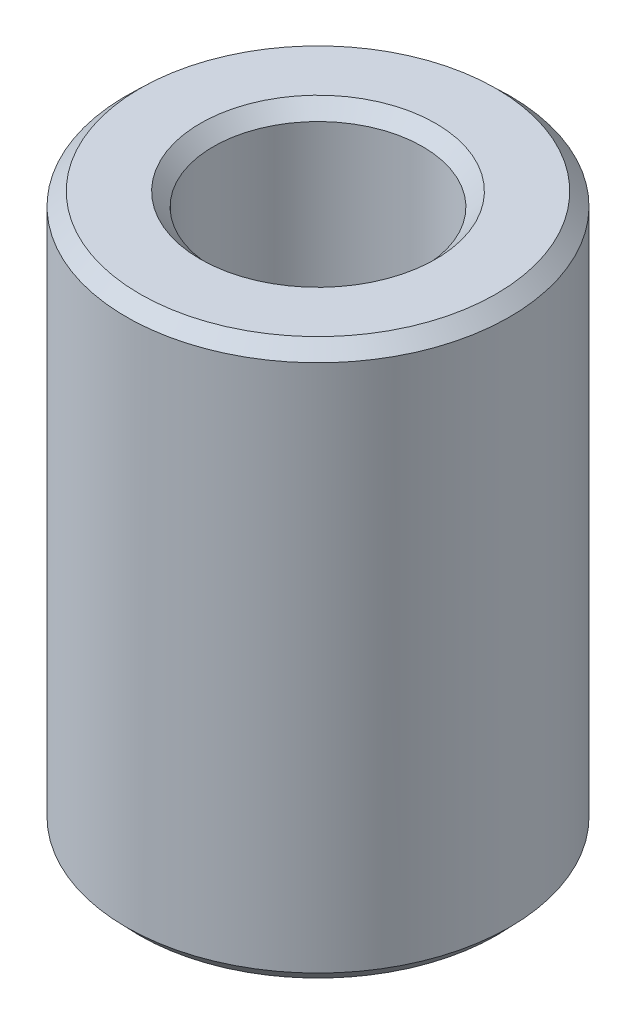
ISO-10303-21;
HEADER;
FILE_DESCRIPTION(('STEP AP214'),'2;1');
FILE_NAME('part.step','',(''),(''),'','','');
FILE_SCHEMA(('AUTOMOTIVE_DESIGN { 1 0 10303 214 1 1 1 1 }'));
ENDSEC;
DATA;
#1=APPLICATION_CONTEXT('core data for automotive mechanical design processes');
#2=APPLICATION_PROTOCOL_DEFINITION('international standard','automotive_design',2000,#1);
#3=PRODUCT_CONTEXT('',#1,'mechanical');
#4=PRODUCT('Part','Part','',(#3));
#5=PRODUCT_RELATED_PRODUCT_CATEGORY('part','',(#4));
#6=PRODUCT_DEFINITION_FORMATION('','',#4);
#7=PRODUCT_DEFINITION_CONTEXT('part definition',#1,'design');
#8=PRODUCT_DEFINITION('design','',#6,#7);
#9=PRODUCT_DEFINITION_SHAPE('','',#8);
#10=(LENGTH_UNIT() NAMED_UNIT(*) SI_UNIT(.MILLI.,.METRE.));
#11=(NAMED_UNIT(*) PLANE_ANGLE_UNIT() SI_UNIT($,.RADIAN.));
#12=(NAMED_UNIT(*) SI_UNIT($,.STERADIAN.) SOLID_ANGLE_UNIT());
#13=UNCERTAINTY_MEASURE_WITH_UNIT(LENGTH_MEASURE(1.E-05),#10,'distance_accuracy_value','');
#14=(GEOMETRIC_REPRESENTATION_CONTEXT(3) GLOBAL_UNCERTAINTY_ASSIGNED_CONTEXT((#13)) GLOBAL_UNIT_ASSIGNED_CONTEXT((#10,
#11,#12)) REPRESENTATION_CONTEXT('',''));
#15=CARTESIAN_POINT('',(0.,0.,0.));
#16=DIRECTION('',(0.,0.,1.));
#17=DIRECTION('',(1.,0.,0.));
#18=AXIS2_PLACEMENT_3D('',#15,#16,#17);
#19=CARTESIAN_POINT('',(0.,28.9694790083316,0.));
#20=DIRECTION('',(0.,-1.,0.));
#21=DIRECTION('',(0.,0.,-1.));
#22=AXIS2_PLACEMENT_3D('',#19,#20,#21);
#23=CYLINDRICAL_SURFACE('',#22,10.);
#24=CARTESIAN_POINT('',(0.,0.708660389524194,0.));
#25=DIRECTION('',(0.,1.,0.));
#26=DIRECTION('',(0.,0.,1.));
#27=AXIS2_PLACEMENT_3D('',#24,#25,#26);
#28=CIRCLE('',#27,10.);
#29=CARTESIAN_POINT('',(0.,0.708660389524191,-10.));
#30=VERTEX_POINT('',#29);
#31=EDGE_CURVE('E10',#30,#30,#28,.T.);
#32=CARTESIAN_POINT('',(0.,28.2883303676083,0.));
#33=DIRECTION('',(0.,1.,0.));
#34=DIRECTION('',(0.,0.,1.));
#35=AXIS2_PLACEMENT_3D('',#32,#33,#34);
#36=CIRCLE('',#35,10.);
#37=CARTESIAN_POINT('',(0.,28.2883303676083,-10.));
#38=VERTEX_POINT('',#37);
#39=EDGE_CURVE('E50',#38,#38,#36,.F.);
#40=CARTESIAN_POINT('',(0.,0.708660389524191,-10.));
#41=CARTESIAN_POINT('',(0.,0.995948618462567,-10.));
#42=CARTESIAN_POINT('',(0.,1.28323684740094,-10.));
#43=CARTESIAN_POINT('',(0.,1.8578133052777,-10.));
#44=CARTESIAN_POINT('',(0.,2.14510153421607,-10.));
#45=CARTESIAN_POINT('',(0.,2.71967799209282,-10.));
#46=CARTESIAN_POINT('',(0.,3.0069662210312,-10.));
#47=CARTESIAN_POINT('',(0.,3.58154267890795,-10.));
#48=CARTESIAN_POINT('',(0.,3.86883090784633,-10.));
#49=CARTESIAN_POINT('',(0.,4.44340736572308,-10.));
#50=CARTESIAN_POINT('',(0.,4.73069559466146,-10.));
#51=CARTESIAN_POINT('',(0.,5.30527205253821,-10.));
#52=CARTESIAN_POINT('',(0.,5.59256028147658,-10.));
#53=CARTESIAN_POINT('',(0.,6.16713673935334,-10.));
#54=CARTESIAN_POINT('',(0.,6.45442496829171,-10.));
#55=CARTESIAN_POINT('',(0.,7.02900142616846,-10.));
#56=CARTESIAN_POINT('',(0.,7.31628965510684,-10.));
#57=CARTESIAN_POINT('',(0.,7.89086611298359,-10.));
#58=CARTESIAN_POINT('',(0.,8.17815434192197,-10.));
#59=CARTESIAN_POINT('',(0.,8.75273079979872,-10.));
#60=CARTESIAN_POINT('',(0.,9.04001902873709,-10.));
#61=CARTESIAN_POINT('',(0.,9.61459548661385,-10.));
#62=CARTESIAN_POINT('',(0.,9.90188371555222,-10.));
#63=CARTESIAN_POINT('',(0.,10.476460173429,-10.));
#64=CARTESIAN_POINT('',(0.,10.7637484023673,-10.));
#65=CARTESIAN_POINT('',(0.,11.3383248602441,-10.));
#66=CARTESIAN_POINT('',(0.,11.6256130891825,-10.));
#67=CARTESIAN_POINT('',(0.,12.2001895470592,-10.));
#68=CARTESIAN_POINT('',(0.,12.4874777759976,-10.));
#69=CARTESIAN_POINT('',(0.,13.0620542338744,-10.));
#70=CARTESIAN_POINT('',(0.,13.3493424628127,-10.));
#71=CARTESIAN_POINT('',(0.,13.9239189206895,-10.));
#72=CARTESIAN_POINT('',(0.,14.2112071496279,-10.));
#73=CARTESIAN_POINT('',(0.,14.7857836075046,-10.));
#74=CARTESIAN_POINT('',(0.,15.073071836443,-10.));
#75=CARTESIAN_POINT('',(0.,15.6476482943197,-10.));
#76=CARTESIAN_POINT('',(0.,15.9349365232581,-10.));
#77=CARTESIAN_POINT('',(0.,16.5095129811349,-10.));
#78=CARTESIAN_POINT('',(0.,16.7968012100732,-10.));
#79=CARTESIAN_POINT('',(0.,17.37137766795,-10.));
#80=CARTESIAN_POINT('',(0.,17.6586658968884,-10.));
#81=CARTESIAN_POINT('',(0.,18.2332423547651,-10.));
#82=CARTESIAN_POINT('',(0.,18.5205305837035,-10.));
#83=CARTESIAN_POINT('',(0.,19.0951070415802,-10.));
#84=CARTESIAN_POINT('',(0.,19.3823952705186,-10.));
#85=CARTESIAN_POINT('',(0.,19.9569717283954,-10.));
#86=CARTESIAN_POINT('',(0.,20.2442599573338,-10.));
#87=CARTESIAN_POINT('',(0.,20.8188364152105,-10.));
#88=CARTESIAN_POINT('',(0.,21.1061246441489,-10.));
#89=CARTESIAN_POINT('',(0.,21.6807011020256,-10.));
#90=CARTESIAN_POINT('',(0.,21.967989330964,-10.));
#91=CARTESIAN_POINT('',(0.,22.5425657888408,-10.));
#92=CARTESIAN_POINT('',(0.,22.8298540177791,-10.));
#93=CARTESIAN_POINT('',(0.,23.4044304756559,-10.));
#94=CARTESIAN_POINT('',(0.,23.6917187045943,-10.));
#95=CARTESIAN_POINT('',(0.,24.266295162471,-10.));
#96=CARTESIAN_POINT('',(0.,24.5535833914094,-10.));
#97=CARTESIAN_POINT('',(0.,25.1281598492861,-10.));
#98=CARTESIAN_POINT('',(0.,25.4154480782245,-10.));
#99=CARTESIAN_POINT('',(0.,25.9900245361013,-10.));
#100=CARTESIAN_POINT('',(0.,26.2773127650396,-10.));
#101=CARTESIAN_POINT('',(0.,26.8518892229164,-10.));
#102=CARTESIAN_POINT('',(0.,27.1391774518548,-10.));
#103=CARTESIAN_POINT('',(0.,27.7137539097315,-10.));
#104=CARTESIAN_POINT('',(0.,28.0010421386699,-10.));
#105=CARTESIAN_POINT('',(0.,28.2883303676083,-10.));
#106=B_SPLINE_CURVE_WITH_KNOTS('',3,(#40,#41,#42,#43,#44,#45,#46,#47,#48,#49,#50,#51,#52,#53,
#54,#55,#56,#57,#58,#59,#60,#61,#62,#63,#64,#65,#66,#67,#68,#69,#70,#71,#72,#73,#74,#75,#76,#77,
#78,#79,#80,#81,#82,#83,#84,#85,#86,#87,#88,#89,#90,#91,#92,#93,#94,#95,#96,#97,#98,#99,#100,
#101,#102,#103,#104,#105),.UNSPECIFIED.,.F.,.F.,(4,2,2,2,2,2,2,2,2,2,2,2,2,2,2,2,2,2,2,2,2,2,2,
2,2,2,2,2,2,2,2,2,4),(0.,0.861864686815129,1.72372937363026,2.58559406044539,3.44745874726051,
4.30932343407564,5.17118812089077,6.0330528077059,6.89491749452102,7.75678218133615,
8.61864686815128,9.48051155496641,10.3423762417815,11.2042409285967,12.0661056154118,
12.9279703022269,13.789834989042,14.6516996758572,15.5135643626723,16.3754290494874,
17.2372937363026,18.0991584231177,18.9610231099328,19.8228877967479,20.6847524835631,
21.5466171703782,22.4084818571933,23.2703465440085,24.1322112308236,24.9940759176387,
25.8559406044538,26.717805291269,27.5796699780841),.UNSPECIFIED.);
#107=EDGE_CURVE('BSEAM39',#30,#38,#106,.T.);
#108=ORIENTED_EDGE('',*,*,#31,.T.);
#109=ORIENTED_EDGE('',*,*,#39,.T.);
#110=ORIENTED_EDGE('',*,*,#107,.T.);
#111=ORIENTED_EDGE('',*,*,#107,.F.);
#112=EDGE_LOOP('',(#108,#110,#109,#111));
#113=FACE_BOUND('',#112,.T.);
#114=ADVANCED_FACE('F39',(#113),#23,.T.);
#115=CARTESIAN_POINT('',(0.,28.9694790083316,0.));
#116=DIRECTION('',(0.,1.,0.));
#117=DIRECTION('',(0.,0.,1.));
#118=AXIS2_PLACEMENT_3D('',#115,#116,#117);
#119=PLANE('',#118);
#120=CARTESIAN_POINT('',(0.,28.9694790083316,0.));
#121=DIRECTION('',(0.,1.,0.));
#122=DIRECTION('',(0.,0.,1.));
#123=AXIS2_PLACEMENT_3D('',#120,#121,#122);
#124=CIRCLE('',#123,6.14048397947353);
#125=CARTESIAN_POINT('',(0.,28.9694790083316,6.14048397947353));
#126=VERTEX_POINT('',#125);
#127=EDGE_CURVE('E58',#126,#126,#124,.F.);
#128=ORIENTED_EDGE('',*,*,#127,.T.);
#129=EDGE_LOOP('',(#128));
#130=FACE_BOUND('',#129,.T.);
#131=CARTESIAN_POINT('',(0.,28.9694790083316,0.));
#132=DIRECTION('',(0.,1.,0.));
#133=DIRECTION('',(0.,0.,1.));
#134=AXIS2_PLACEMENT_3D('',#131,#132,#133);
#135=CIRCLE('',#134,9.29133961047585);
#136=CARTESIAN_POINT('',(0.,28.9694790083316,9.29133961047585));
#137=VERTEX_POINT('',#136);
#138=EDGE_CURVE('E61',#137,#137,#135,.T.);
#139=ORIENTED_EDGE('',*,*,#138,.T.);
#140=EDGE_LOOP('',(#139));
#141=FACE_BOUND('',#140,.T.);
#142=ADVANCED_FACE('F88',(#130,#141),#119,.T.);
#143=CARTESIAN_POINT('',(0.,0.,0.));
#144=DIRECTION('',(0.,1.,0.));
#145=DIRECTION('',(0.,0.,1.));
#146=AXIS2_PLACEMENT_3D('',#143,#144,#145);
#147=PLANE('',#146);
#148=CARTESIAN_POINT('',(0.,0.,0.));
#149=DIRECTION('',(0.,1.,0.));
#150=DIRECTION('',(0.,0.,1.));
#151=AXIS2_PLACEMENT_3D('',#148,#149,#150);
#152=CIRCLE('',#151,6.16799572827433);
#153=CARTESIAN_POINT('',(0.,0.,6.16799572827433));
#154=VERTEX_POINT('',#153);
#155=EDGE_CURVE('E51',#154,#154,#152,.T.);
#156=ORIENTED_EDGE('',*,*,#155,.T.);
#157=EDGE_LOOP('',(#156));
#158=FACE_BOUND('',#157,.T.);
#159=CARTESIAN_POINT('',(0.,0.,0.));
#160=DIRECTION('',(0.,1.,0.));
#161=DIRECTION('',(0.,0.,1.));
#162=AXIS2_PLACEMENT_3D('',#159,#160,#161);
#163=CIRCLE('',#162,9.31885135927664);
#164=CARTESIAN_POINT('',(0.,0.,9.31885135927664));
#165=VERTEX_POINT('',#164);
#166=EDGE_CURVE('E54',#165,#165,#163,.F.);
#167=ORIENTED_EDGE('',*,*,#166,.T.);
#168=EDGE_LOOP('',(#167));
#169=FACE_BOUND('',#168,.T.);
#170=ADVANCED_FACE('F83',(#158,#169),#147,.F.);
#171=CARTESIAN_POINT('',(0.,28.9694790083316,0.));
#172=DIRECTION('',(0.,-1.,0.));
#173=DIRECTION('',(0.,0.,-1.));
#174=AXIS2_PLACEMENT_3D('',#171,#172,#173);
#175=CYLINDRICAL_SURFACE('',#174,5.45933533875017);
#176=CARTESIAN_POINT('',(0.,28.2608186188074,0.));
#177=DIRECTION('',(0.,1.,0.));
#178=DIRECTION('',(0.,0.,1.));
#179=AXIS2_PLACEMENT_3D('',#176,#177,#178);
#180=CIRCLE('',#179,5.45933533875017);
#181=CARTESIAN_POINT('',(0.,28.2608186188074,-5.45933533875017));
#182=VERTEX_POINT('',#181);
#183=EDGE_CURVE('E67',#182,#182,#180,.T.);
#184=CARTESIAN_POINT('',(0.,0.681148640723325,0.));
#185=DIRECTION('',(0.,1.,0.));
#186=DIRECTION('',(0.,0.,1.));
#187=AXIS2_PLACEMENT_3D('',#184,#185,#186);
#188=CIRCLE('',#187,5.45933533875017);
#189=CARTESIAN_POINT('',(0.,0.681148640723321,-5.45933533875017));
#190=VERTEX_POINT('',#189);
#191=EDGE_CURVE('E69',#190,#190,#188,.F.);
#192=CARTESIAN_POINT('',(0.,28.2608186188074,-5.45933533875017));
#193=CARTESIAN_POINT('',(0.,27.973530389869,-5.45933533875017));
#194=CARTESIAN_POINT('',(0.,27.6862421609306,-5.45933533875017));
#195=CARTESIAN_POINT('',(0.,27.1116657030539,-5.45933533875017));
#196=CARTESIAN_POINT('',(0.,26.8243774741155,-5.45933533875017));
#197=CARTESIAN_POINT('',(0.,26.2498010162388,-5.45933533875017));
#198=CARTESIAN_POINT('',(0.,25.9625127873004,-5.45933533875017));
#199=CARTESIAN_POINT('',(0.,25.3879363294236,-5.45933533875017));
#200=CARTESIAN_POINT('',(0.,25.1006481004853,-5.45933533875017));
#201=CARTESIAN_POINT('',(0.,24.5260716426085,-5.45933533875017));
#202=CARTESIAN_POINT('',(0.,24.2387834136701,-5.45933533875017));
#203=CARTESIAN_POINT('',(0.,23.6642069557934,-5.45933533875017));
#204=CARTESIAN_POINT('',(0.,23.376918726855,-5.45933533875017));
#205=CARTESIAN_POINT('',(0.,22.8023422689783,-5.45933533875017));
#206=CARTESIAN_POINT('',(0.,22.5150540400399,-5.45933533875017));
#207=CARTESIAN_POINT('',(0.,21.9404775821631,-5.45933533875017));
#208=CARTESIAN_POINT('',(0.,21.6531893532248,-5.45933533875017));
#209=CARTESIAN_POINT('',(0.,21.078612895348,-5.45933533875017));
#210=CARTESIAN_POINT('',(0.,20.7913246664096,-5.45933533875017));
#211=CARTESIAN_POINT('',(0.,20.2167482085329,-5.45933533875017));
#212=CARTESIAN_POINT('',(0.,19.9294599795945,-5.45933533875017));
#213=CARTESIAN_POINT('',(0.,19.3548835217178,-5.45933533875017));
#214=CARTESIAN_POINT('',(0.,19.0675952927794,-5.45933533875017));
#215=CARTESIAN_POINT('',(0.,18.4930188349026,-5.45933533875017));
#216=CARTESIAN_POINT('',(0.,18.2057306059642,-5.45933533875017));
#217=CARTESIAN_POINT('',(0.,17.6311541480875,-5.45933533875017));
#218=CARTESIAN_POINT('',(0.,17.3438659191491,-5.45933533875017));
#219=CARTESIAN_POINT('',(0.,16.7692894612724,-5.45933533875017));
#220=CARTESIAN_POINT('',(0.,16.482001232334,-5.45933533875017));
#221=CARTESIAN_POINT('',(0.,15.9074247744572,-5.45933533875017));
#222=CARTESIAN_POINT('',(0.,15.6201365455189,-5.45933533875017));
#223=CARTESIAN_POINT('',(0.,15.0455600876421,-5.45933533875017));
#224=CARTESIAN_POINT('',(0.,14.7582718587037,-5.45933533875017));
#225=CARTESIAN_POINT('',(0.,14.183695400827,-5.45933533875017));
#226=CARTESIAN_POINT('',(0.,13.8964071718886,-5.45933533875017));
#227=CARTESIAN_POINT('',(0.,13.3218307140119,-5.45933533875017));
#228=CARTESIAN_POINT('',(0.,13.0345424850735,-5.45933533875017));
#229=CARTESIAN_POINT('',(0.,12.4599660271967,-5.45933533875017));
#230=CARTESIAN_POINT('',(0.,12.1726777982584,-5.45933533875017));
#231=CARTESIAN_POINT('',(0.,11.5981013403816,-5.45933533875017));
#232=CARTESIAN_POINT('',(0.,11.3108131114432,-5.45933533875017));
#233=CARTESIAN_POINT('',(0.,10.7362366535665,-5.45933533875017));
#234=CARTESIAN_POINT('',(0.,10.4489484246281,-5.45933533875017));
#235=CARTESIAN_POINT('',(0.,9.87437196675135,-5.45933533875017));
#236=CARTESIAN_POINT('',(0.,9.58708373781297,-5.45933533875017));
#237=CARTESIAN_POINT('',(0.,9.01250727993622,-5.45933533875017));
#238=CARTESIAN_POINT('',(0.,8.72521905099784,-5.45933533875017));
#239=CARTESIAN_POINT('',(0.,8.15064259312109,-5.45933533875017));
#240=CARTESIAN_POINT('',(0.,7.86335436418272,-5.45933533875017));
#241=CARTESIAN_POINT('',(0.,7.28877790630597,-5.45933533875017));
#242=CARTESIAN_POINT('',(0.,7.00148967736759,-5.45933533875017));
#243=CARTESIAN_POINT('',(0.,6.42691321949084,-5.45933533875017));
#244=CARTESIAN_POINT('',(0.,6.13962499055246,-5.45933533875017));
#245=CARTESIAN_POINT('',(0.,5.56504853267571,-5.45933533875017));
#246=CARTESIAN_POINT('',(0.,5.27776030373733,-5.45933533875017));
#247=CARTESIAN_POINT('',(0.,4.70318384586058,-5.45933533875017));
#248=CARTESIAN_POINT('',(0.,4.41589561692221,-5.45933533875017));
#249=CARTESIAN_POINT('',(0.,3.84131915904546,-5.45933533875017));
#250=CARTESIAN_POINT('',(0.,3.55403093010708,-5.45933533875017));
#251=CARTESIAN_POINT('',(0.,2.97945447223033,-5.45933533875017));
#252=CARTESIAN_POINT('',(0.,2.69216624329195,-5.45933533875017));
#253=CARTESIAN_POINT('',(0.,2.1175897854152,-5.45933533875017));
#254=CARTESIAN_POINT('',(0.,1.83030155647682,-5.45933533875017));
#255=CARTESIAN_POINT('',(0.,1.25572509860007,-5.45933533875017));
#256=CARTESIAN_POINT('',(0.,0.968436869661696,-5.45933533875017));
#257=CARTESIAN_POINT('',(0.,0.681148640723321,-5.45933533875017));
#258=B_SPLINE_CURVE_WITH_KNOTS('',3,(#192,#193,#194,#195,#196,#197,#198,#199,#200,#201,#202,
#203,#204,#205,#206,#207,#208,#209,#210,#211,#212,#213,#214,#215,#216,#217,#218,#219,#220,#221,
#222,#223,#224,#225,#226,#227,#228,#229,#230,#231,#232,#233,#234,#235,#236,#237,#238,#239,#240,
#241,#242,#243,#244,#245,#246,#247,#248,#249,#250,#251,#252,#253,#254,#255,#256,#257),
.UNSPECIFIED.,.F.,.F.,(4,2,2,2,2,2,2,2,2,2,2,2,2,2,2,2,2,2,2,2,2,2,2,2,2,2,2,2,2,2,2,2,4),(0.,
0.861864686815126,1.72372937363025,2.58559406044538,3.44745874726051,4.30932343407564,
5.17118812089076,6.03305280770589,6.89491749452102,7.75678218133614,8.61864686815127,
9.4805115549664,10.3423762417815,11.2042409285967,12.0661056154118,12.9279703022269,
13.789834989042,14.6516996758572,15.5135643626723,16.3754290494874,17.2372937363025,
18.0991584231177,18.9610231099328,19.8228877967479,20.6847524835631,21.5466171703782,
22.4084818571933,23.2703465440084,24.1322112308236,24.9940759176387,25.8559406044538,
26.717805291269,27.5796699780841),.UNSPECIFIED.);
#259=EDGE_CURVE('BSEAM71',#182,#190,#258,.T.);
#260=ORIENTED_EDGE('',*,*,#183,.T.);
#261=ORIENTED_EDGE('',*,*,#191,.T.);
#262=ORIENTED_EDGE('',*,*,#259,.T.);
#263=ORIENTED_EDGE('',*,*,#259,.F.);
#264=EDGE_LOOP('',(#260,#262,#261,#263));
#265=FACE_BOUND('',#264,.T.);
#266=ADVANCED_FACE('F71',(#265),#175,.F.);
#267=CARTESIAN_POINT('',(0.,28.2608186188074,0.));
#268=DIRECTION('',(0.,1.,0.));
#269=DIRECTION('',(0.,0.,1.));
#270=AXIS2_PLACEMENT_3D('',#267,#268,#269);
#271=CONICAL_SURFACE('',#270,5.45933533875017,0.765605403743515);
#272=ORIENTED_EDGE('',*,*,#127,.F.);
#273=EDGE_LOOP('',(#272));
#274=FACE_BOUND('',#273,.T.);
#275=ORIENTED_EDGE('',*,*,#183,.F.);
#276=EDGE_LOOP('',(#275));
#277=FACE_BOUND('',#276,.T.);
#278=ADVANCED_FACE('F77',(#274,#277),#271,.F.);
#279=CARTESIAN_POINT('',(0.,0.,0.));
#280=DIRECTION('',(0.,-1.,0.));
#281=DIRECTION('',(0.,0.,-1.));
#282=AXIS2_PLACEMENT_3D('',#279,#280,#281);
#283=CONICAL_SURFACE('',#282,6.16799572827433,0.805190923051385);
#284=ORIENTED_EDGE('',*,*,#191,.F.);
#285=EDGE_LOOP('',(#284));
#286=FACE_BOUND('',#285,.T.);
#287=ORIENTED_EDGE('',*,*,#155,.F.);
#288=EDGE_LOOP('',(#287));
#289=FACE_BOUND('',#288,.T.);
#290=ADVANCED_FACE('F73',(#286,#289),#283,.F.);
#291=CARTESIAN_POINT('',(0.,0.708660389524194,0.));
#292=DIRECTION('',(0.,1.,0.));
#293=DIRECTION('',(0.,0.,1.));
#294=AXIS2_PLACEMENT_3D('',#291,#292,#293);
#295=CONICAL_SURFACE('',#294,10.,0.765605403743515);
#296=ORIENTED_EDGE('',*,*,#166,.F.);
#297=EDGE_LOOP('',(#296));
#298=FACE_BOUND('',#297,.T.);
#299=ORIENTED_EDGE('',*,*,#31,.F.);
#300=EDGE_LOOP('',(#299));
#301=FACE_BOUND('',#300,.T.);
#302=ADVANCED_FACE('F76',(#298,#301),#295,.T.);
#303=CARTESIAN_POINT('',(0.,28.9694790083316,0.));
#304=DIRECTION('',(0.,-1.,0.));
#305=DIRECTION('',(0.,0.,-1.));
#306=AXIS2_PLACEMENT_3D('',#303,#304,#305);
#307=CONICAL_SURFACE('',#306,9.29133961047585,0.805190923051386);
#308=ORIENTED_EDGE('',*,*,#39,.F.);
#309=EDGE_LOOP('',(#308));
#310=FACE_BOUND('',#309,.T.);
#311=ORIENTED_EDGE('',*,*,#138,.F.);
#312=EDGE_LOOP('',(#311));
#313=FACE_BOUND('',#312,.T.);
#314=ADVANCED_FACE('F45',(#310,#313),#307,.T.);
#315=CLOSED_SHELL('',(#114,#142,#170,#266,#278,#290,#302,#314));
#316=MANIFOLD_SOLID_BREP('B2',#315);
#317=ADVANCED_BREP_SHAPE_REPRESENTATION('',(#18,#316),#14);
#318=SHAPE_DEFINITION_REPRESENTATION(#9,#317);
ENDSEC;
END-ISO-10303-21;
